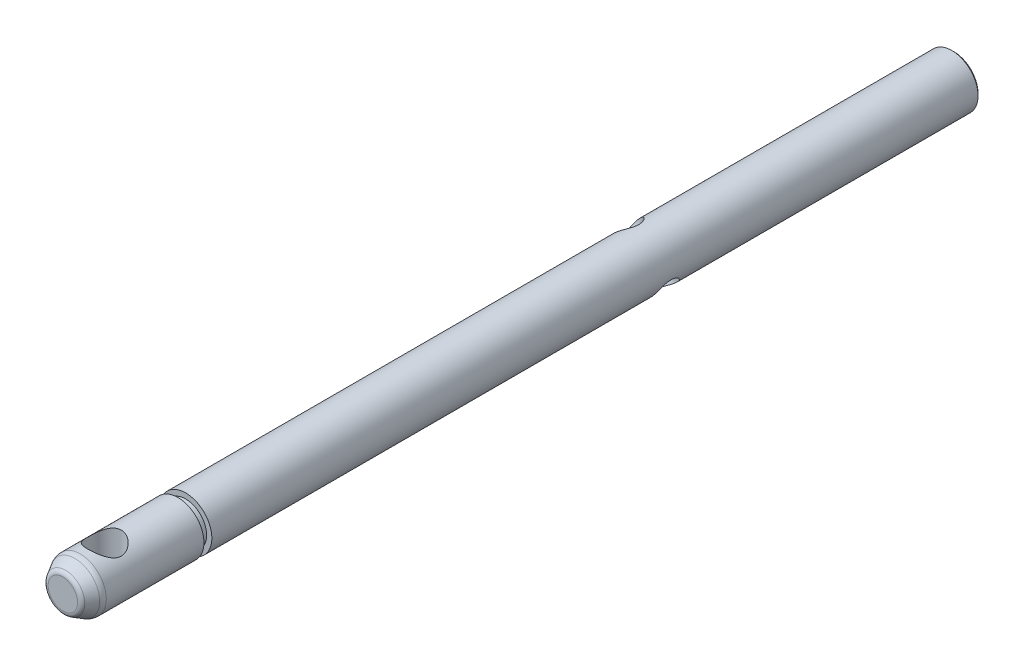
ISO-10303-21;
HEADER;
FILE_DESCRIPTION(('STEP AP214'),'2;1');
FILE_NAME('part.step','',(''),(''),'','','');
FILE_SCHEMA(('AUTOMOTIVE_DESIGN { 1 0 10303 214 1 1 1 1 }'));
ENDSEC;
DATA;
#1=APPLICATION_CONTEXT('core data for automotive mechanical design processes');
#2=APPLICATION_PROTOCOL_DEFINITION('international standard','automotive_design',2000,#1);
#3=PRODUCT_CONTEXT('',#1,'mechanical');
#4=PRODUCT('Part','Part','',(#3));
#5=PRODUCT_RELATED_PRODUCT_CATEGORY('part','',(#4));
#6=PRODUCT_DEFINITION_FORMATION('','',#4);
#7=PRODUCT_DEFINITION_CONTEXT('part definition',#1,'design');
#8=PRODUCT_DEFINITION('design','',#6,#7);
#9=PRODUCT_DEFINITION_SHAPE('','',#8);
#10=(LENGTH_UNIT() NAMED_UNIT(*) SI_UNIT(.MILLI.,.METRE.));
#11=(NAMED_UNIT(*) PLANE_ANGLE_UNIT() SI_UNIT($,.RADIAN.));
#12=(NAMED_UNIT(*) SI_UNIT($,.STERADIAN.) SOLID_ANGLE_UNIT());
#13=UNCERTAINTY_MEASURE_WITH_UNIT(LENGTH_MEASURE(1.E-05),#10,'distance_accuracy_value','');
#14=(GEOMETRIC_REPRESENTATION_CONTEXT(3) GLOBAL_UNCERTAINTY_ASSIGNED_CONTEXT((#13)) GLOBAL_UNIT_ASSIGNED_CONTEXT((#10,
#11,#12)) REPRESENTATION_CONTEXT('',''));
#15=CARTESIAN_POINT('',(0.,0.,0.));
#16=DIRECTION('',(0.,0.,1.));
#17=DIRECTION('',(1.,0.,0.));
#18=AXIS2_PLACEMENT_3D('',#15,#16,#17);
#19=CARTESIAN_POINT('',(0.,0.,10.3643593547193));
#20=DIRECTION('',(0.,0.,-1.));
#21=DIRECTION('',(-1.,0.,0.));
#22=AXIS2_PLACEMENT_3D('',#19,#20,#21);
#23=CONICAL_SURFACE('',#22,2.4999999995529,0.523598775598287);
#24=CARTESIAN_POINT('',(0.,0.,11.5));
#25=DIRECTION('',(0.,0.,1.));
#26=DIRECTION('',(1.,0.,0.));
#27=AXIS2_PLACEMENT_3D('',#24,#25,#26);
#28=CIRCLE('',#27,1.84433756729739);
#29=CARTESIAN_POINT('',(1.84433756729739,0.,11.5));
#30=VERTEX_POINT('',#29);
#31=EDGE_CURVE('E52',#30,#30,#28,.F.);
#32=ORIENTED_EDGE('',*,*,#31,.T.);
#33=EDGE_LOOP('',(#32));
#34=FACE_BOUND('',#33,.T.);
#35=CARTESIAN_POINT('',(0.,0.,10.5964101622881));
#36=DIRECTION('',(0.,0.,1.));
#37=DIRECTION('',(1.,0.,0.));
#38=AXIS2_PLACEMENT_3D('',#35,#36,#37);
#39=CIRCLE('',#38,2.36602540333735);
#40=CARTESIAN_POINT('',(2.36602540333735,0.,10.5964101622881));
#41=VERTEX_POINT('',#40);
#42=EDGE_CURVE('E163',#41,#41,#39,.T.);
#43=ORIENTED_EDGE('',*,*,#42,.T.);
#44=EDGE_LOOP('',(#43));
#45=FACE_BOUND('',#44,.T.);
#46=ADVANCED_FACE('F45',(#34,#45),#23,.T.);
#47=CARTESIAN_POINT('',(1.69999999999998,0.,11.75));
#48=DIRECTION('',(0.,0.,1.));
#49=DIRECTION('',(1.,0.,0.));
#50=AXIS2_PLACEMENT_3D('',#47,#48,#49);
#51=PLANE('',#50);
#52=CARTESIAN_POINT('',(0.,0.,11.75));
#53=DIRECTION('',(0.,0.,1.));
#54=DIRECTION('',(1.,0.,0.));
#55=AXIS2_PLACEMENT_3D('',#52,#53,#54);
#56=CIRCLE('',#55,1.41132486540517);
#57=CARTESIAN_POINT('',(1.41132486540517,0.,11.75));
#58=VERTEX_POINT('',#57);
#59=EDGE_CURVE('E12',#58,#58,#56,.T.);
#60=ORIENTED_EDGE('',*,*,#59,.T.);
#61=EDGE_LOOP('',(#60));
#62=FACE_BOUND('',#61,.T.);
#63=ADVANCED_FACE('F141',(#62),#51,.T.);
#64=CARTESIAN_POINT('',(0.,0.,-73.5));
#65=DIRECTION('',(0.,0.,-1.));
#66=DIRECTION('',(-1.,0.,0.));
#67=AXIS2_PLACEMENT_3D('',#64,#65,#66);
#68=PLANE('',#67);
#69=CARTESIAN_POINT('',(0.,0.,-73.5));
#70=DIRECTION('',(0.,0.,-1.));
#71=DIRECTION('',(-1.,0.,0.));
#72=AXIS2_PLACEMENT_3D('',#69,#70,#71);
#73=CIRCLE('',#72,2.29999999955291);
#74=CARTESIAN_POINT('',(-2.29999999955291,0.,-73.5));
#75=VERTEX_POINT('',#74);
#76=EDGE_CURVE('E127',#75,#75,#73,.T.);
#77=ORIENTED_EDGE('',*,*,#76,.T.);
#78=EDGE_LOOP('',(#77));
#79=FACE_BOUND('',#78,.T.);
#80=CARTESIAN_POINT('',(0.,0.,-73.5));
#81=DIRECTION('',(0.,0.,-1.));
#82=DIRECTION('',(-1.,0.,0.));
#83=AXIS2_PLACEMENT_3D('',#80,#81,#82);
#84=CIRCLE('',#83,1.5);
#85=CARTESIAN_POINT('',(-1.5,0.,-73.5));
#86=VERTEX_POINT('',#85);
#87=EDGE_CURVE('E76',#86,#86,#84,.T.);
#88=ORIENTED_EDGE('',*,*,#87,.F.);
#89=EDGE_LOOP('',(#88));
#90=FACE_BOUND('',#89,.T.);
#91=ADVANCED_FACE('F135',(#79,#90),#68,.T.);
#92=CARTESIAN_POINT('',(0.,0.,11.75));
#93=DIRECTION('',(0.,0.,-1.));
#94=DIRECTION('',(-1.,0.,0.));
#95=AXIS2_PLACEMENT_3D('',#92,#93,#94);
#96=CYLINDRICAL_SURFACE('',#95,2.4999999995529);
#97=CARTESIAN_POINT('',(0.,0.,-73.3));
#98=DIRECTION('',(0.,0.,-1.));
#99=DIRECTION('',(-1.,0.,0.));
#100=AXIS2_PLACEMENT_3D('',#97,#98,#99);
#101=CIRCLE('',#100,2.4999999995529);
#102=CARTESIAN_POINT('',(-2.4999999995529,0.,-73.3));
#103=VERTEX_POINT('',#102);
#104=EDGE_CURVE('E168',#103,#103,#101,.F.);
#105=ORIENTED_EDGE('',*,*,#104,.T.);
#106=EDGE_LOOP('',(#105));
#107=FACE_BOUND('',#106,.T.);
#108=CARTESIAN_POINT('',(0.647047612391243,-2.41481456535761,-44.));
#109=CARTESIAN_POINT('',(0.647054839589281,-2.414815363319,-44.0651347602423));
#110=CARTESIAN_POINT('',(0.652781570956877,-2.41330062767963,-44.1303517644026));
#111=CARTESIAN_POINT('',(0.675198989154534,-2.40712130266853,-44.258784080839));
#112=CARTESIAN_POINT('',(0.691912714261657,-2.40245009401281,-44.3219948937949));
#113=CARTESIAN_POINT('',(0.734854992081506,-2.38966154607353,-44.4443145804166));
#114=CARTESIAN_POINT('',(0.761032937966934,-2.38156249745004,-44.5034433155767));
#115=CARTESIAN_POINT('',(0.821268395297311,-2.36146633386545,-44.6167802524769));
#116=CARTESIAN_POINT('',(0.855326333007327,-2.34946900801437,-44.6709881878074));
#117=CARTESIAN_POINT('',(0.932764132759461,-2.319871712233,-44.7778821606749));
#118=CARTESIAN_POINT('',(0.976681165090613,-2.30189126083676,-44.8300739195701));
#119=CARTESIAN_POINT('',(1.06991091377899,-2.26006674587122,-44.9267604854874));
#120=CARTESIAN_POINT('',(1.11922630165018,-2.23621977175588,-44.971251453209));
#121=CARTESIAN_POINT('',(1.22481961227848,-2.18027920094425,-45.0542089389173));
#122=CARTESIAN_POINT('',(1.28134278420145,-2.14773807638739,-45.0920672098093));
#123=CARTESIAN_POINT('',(1.39596184058318,-2.07506193699265,-45.1564260665464));
#124=CARTESIAN_POINT('',(1.45405670780787,-2.03493173775572,-45.1829338201628));
#125=CARTESIAN_POINT('',(1.56514521148729,-1.95059785765576,-45.2218808266209));
#126=CARTESIAN_POINT('',(1.6182076915843,-1.90688720020561,-45.2351869079403));
#127=CARTESIAN_POINT('',(1.72136767494027,-1.81430029508382,-45.2502076483425));
#128=CARTESIAN_POINT('',(1.77146695399875,-1.76542719113136,-45.2519293209947));
#129=CARTESIAN_POINT('',(1.86275114247436,-1.66859283547372,-45.2440666575398));
#130=CARTESIAN_POINT('',(1.90433239278944,-1.6209218750637,-45.2354524806028));
#131=CARTESIAN_POINT('',(1.98260033333465,-1.52419401693175,-45.2088989451273));
#132=CARTESIAN_POINT('',(2.01928665704908,-1.47513701576061,-45.19095888879));
#133=CARTESIAN_POINT('',(2.08775506658209,-1.37656581934683,-45.1461467924029));
#134=CARTESIAN_POINT('',(2.1194622776723,-1.32705468907948,-45.119154608553));
#135=CARTESIAN_POINT('',(2.17731724412714,-1.22983516690986,-45.0571707297724));
#136=CARTESIAN_POINT('',(2.20346300264108,-1.18212742755732,-45.0221761708998));
#137=CARTESIAN_POINT('',(2.25268098848386,-1.08564780758512,-44.9413808106183));
#138=CARTESIAN_POINT('',(2.27522905936719,-1.03720162554881,-44.8948712146303));
#139=CARTESIAN_POINT('',(2.31457949972472,-0.946143375817124,-44.7942628438816));
#140=CARTESIAN_POINT('',(2.33137745599567,-0.903535804217852,-44.7401582847051));
#141=CARTESIAN_POINT('',(2.36080582719395,-0.823723031227638,-44.6216897595221));
#142=CARTESIAN_POINT('',(2.3731038454062,-0.787032726395938,-44.5568924712353));
#143=CARTESIAN_POINT('',(2.39273763825298,-0.725169284214916,-44.421327910855));
#144=CARTESIAN_POINT('',(2.40007859359442,-0.699984131580012,-44.3505669587816));
#145=CARTESIAN_POINT('',(2.41002017068561,-0.664915617025871,-44.2109818609492));
#146=CARTESIAN_POINT('',(2.41295034288321,-0.65397781463655,-44.1424486012477));
#147=CARTESIAN_POINT('',(2.41538496423121,-0.64493640317592,-44.0044983231546));
#148=CARTESIAN_POINT('',(2.41489183324915,-0.646823728247396,-43.9350819636493));
#149=CARTESIAN_POINT('',(2.41068559313306,-0.662300360405999,-43.8054326018269));
#150=CARTESIAN_POINT('',(2.40733062162319,-0.674586991523311,-43.7450256861679));
#151=CARTESIAN_POINT('',(2.39765457982992,-0.708206270758844,-43.6270402672186));
#152=CARTESIAN_POINT('',(2.39133254893351,-0.72954184834184,-43.5694626866261));
#153=CARTESIAN_POINT('',(2.37500357133458,-0.781100760934234,-43.4557358364347));
#154=CARTESIAN_POINT('',(2.36483951834154,-0.811689967423389,-43.3997762289978));
#155=CARTESIAN_POINT('',(2.34038932402502,-0.879706358529646,-43.2931634106434));
#156=CARTESIAN_POINT('',(2.32610106381395,-0.917137054453419,-43.2425129456762));
#157=CARTESIAN_POINT('',(2.29077596584783,-1.00236170749265,-43.1412765406612));
#158=CARTESIAN_POINT('',(2.26911547503706,-1.05086723675192,-43.0915035616659));
#159=CARTESIAN_POINT('',(2.21920764978906,-1.15252912344673,-43.0007347025646));
#160=CARTESIAN_POINT('',(2.19095809709732,-1.20568704336891,-42.9597417872648));
#161=CARTESIAN_POINT('',(2.12657854793458,-1.31599488711738,-42.8867828426057));
#162=CARTESIAN_POINT('',(2.09026024861407,-1.37321314124186,-42.8550836022741));
#163=CARTESIAN_POINT('',(2.01026561196557,-1.48785094176887,-42.8035776202047));
#164=CARTESIAN_POINT('',(1.96659577896656,-1.54527026667838,-42.783760435813));
#165=CARTESIAN_POINT('',(1.87706335552591,-1.65259286928383,-42.7582892947925));
#166=CARTESIAN_POINT('',(1.83176959422813,-1.7027023764808,-42.751502655161));
#167=CARTESIAN_POINT('',(1.73709205755758,-1.79918661459383,-42.748945918179));
#168=CARTESIAN_POINT('',(1.68770971981163,-1.84556264705788,-42.7531719643381));
#169=CARTESIAN_POINT('',(1.58993109636592,-1.93029339625746,-42.7717705084784));
#170=CARTESIAN_POINT('',(1.54168425741229,-1.96897530484538,-42.7854560615513));
#171=CARTESIAN_POINT('',(1.44468543123078,-2.04121123379296,-42.8216587490984));
#172=CARTESIAN_POINT('',(1.39593337253776,-2.07476451781911,-42.8441771500815));
#173=CARTESIAN_POINT('',(1.29739589904163,-2.13783368514683,-42.8984088151614));
#174=CARTESIAN_POINT('',(1.24765546958488,-2.16711550813563,-42.9304741539578));
#175=CARTESIAN_POINT('',(1.15091058730697,-2.2200112129777,-43.0024474135096));
#176=CARTESIAN_POINT('',(1.10390740400748,-2.24362248046623,-43.042358936324));
#177=CARTESIAN_POINT('',(1.00972382125355,-2.28766730752604,-43.1334964236954));
#178=CARTESIAN_POINT('',(0.962991317457852,-2.30755076858136,-43.1854531092577));
#179=CARTESIAN_POINT('',(0.876783659406933,-2.34166723390337,-43.2968134013121));
#180=CARTESIAN_POINT('',(0.837314932917578,-2.35589524641306,-43.3562235259789));
#181=CARTESIAN_POINT('',(0.766826344342654,-2.37979185397499,-43.4832958081133));
#182=CARTESIAN_POINT('',(0.736112899077592,-2.38930215352926,-43.5511594137968));
#183=CARTESIAN_POINT('',(0.687469412415883,-2.40375671037896,-43.6916655053102));
#184=CARTESIAN_POINT('',(0.669496628789736,-2.40871625115548,-43.764291111027));
#185=CARTESIAN_POINT('',(0.654891999223841,-2.41270113483274,-43.8647566944711));
#186=CARTESIAN_POINT('',(0.651957034909512,-2.41349456267658,-43.8917098679221));
#187=CARTESIAN_POINT('',(0.648033271709243,-2.41455112954277,-43.945770600815));
#188=CARTESIAN_POINT('',(0.647044603017562,-2.41481423308998,-43.9728781704634));
#189=CARTESIAN_POINT('',(0.647047612391243,-2.41481456535761,-44.));
#190=B_SPLINE_CURVE_WITH_KNOTS('',3,(#108,#109,#110,#111,#112,#113,#114,#115,#116,#117,#118,
#119,#120,#121,#122,#123,#124,#125,#126,#127,#128,#129,#130,#131,#132,#133,#134,#135,#136,#137,
#138,#139,#140,#141,#142,#143,#144,#145,#146,#147,#148,#149,#150,#151,#152,#153,#154,#155,#156,
#157,#158,#159,#160,#161,#162,#163,#164,#165,#166,#167,#168,#169,#170,#171,#172,#173,#174,#175,
#176,#177,#178,#179,#180,#181,#182,#183,#184,#185,#186,#187,#188,#189),.UNSPECIFIED.,.T.,.F.,(4,
2,2,2,2,2,2,2,2,2,2,2,2,2,2,2,2,2,2,2,2,2,2,2,2,2,2,2,2,2,2,2,2,2,2,2,2,2,2,2,4),(0.,
0.195290153237882,0.390991116019818,0.58566074488149,0.78034090678345,0.991077890599507,
1.20191963853108,1.42697365296704,1.65188533703714,1.8607935620885,2.06957529606556,
2.26020121854114,2.45084140644694,2.64411918411161,2.8374662418442,3.04908989317466,
3.26087560303533,3.48611052158554,3.71110967761977,3.91827863565462,4.12530116483504,
4.30967729277165,4.4941131554131,4.6870912050286,4.8801685776933,5.0975842946998,
5.31507331216917,5.53830226761101,5.7613347475658,5.96390337982664,6.16640108488456,
6.35555531084749,6.5447366688479,6.74200938393286,6.93937287619017,7.15637802305408,
7.37357428548982,7.59763436291689,7.82093916247776,7.90225168981629,7.98356965623837),.UNSPECIFIED.);
#191=CARTESIAN_POINT('',(0.647047612391243,-2.41481456535761,-44.));
#192=VERTEX_POINT('',#191);
#193=EDGE_CURVE('E67',#192,#192,#190,.T.);
#194=ORIENTED_EDGE('',*,*,#193,.F.);
#195=EDGE_LOOP('',(#194));
#196=FACE_BOUND('',#195,.T.);
#197=CARTESIAN_POINT('',(-2.41481456535761,0.647047612391244,-44.));
#198=CARTESIAN_POINT('',(-2.414815363319,0.647054839589282,-43.9348652397577));
#199=CARTESIAN_POINT('',(-2.41330062767963,0.652781570956878,-43.8696482355974));
#200=CARTESIAN_POINT('',(-2.40712130266853,0.675198989154535,-43.741215919161));
#201=CARTESIAN_POINT('',(-2.40245009401281,0.691912714261658,-43.6780051062051));
#202=CARTESIAN_POINT('',(-2.38966154607354,0.734854992081505,-43.5556854195834));
#203=CARTESIAN_POINT('',(-2.38156249745004,0.76103293796693,-43.4965566844233));
#204=CARTESIAN_POINT('',(-2.36146633386545,0.821268395297306,-43.3832197475231));
#205=CARTESIAN_POINT('',(-2.34946900801437,0.855326333007324,-43.3290118121926));
#206=CARTESIAN_POINT('',(-2.319871712233,0.932764132759461,-43.2221178393251));
#207=CARTESIAN_POINT('',(-2.30189126083676,0.976681165090613,-43.1699260804299));
#208=CARTESIAN_POINT('',(-2.26006674587122,1.06991091377899,-43.0732395145126));
#209=CARTESIAN_POINT('',(-2.23621977175588,1.11922630165018,-43.028748546791));
#210=CARTESIAN_POINT('',(-2.18027920094425,1.22481961227848,-42.9457910610827));
#211=CARTESIAN_POINT('',(-2.14773807638739,1.28134278420145,-42.9079327901907));
#212=CARTESIAN_POINT('',(-2.07506193699265,1.39596184058317,-42.8435739334536));
#213=CARTESIAN_POINT('',(-2.03493173775572,1.45405670780787,-42.8170661798372));
#214=CARTESIAN_POINT('',(-1.95059785765576,1.56514521148729,-42.7781191733791));
#215=CARTESIAN_POINT('',(-1.90688720020561,1.6182076915843,-42.7648130920596));
#216=CARTESIAN_POINT('',(-1.81430029508382,1.72136767494027,-42.7497923516575));
#217=CARTESIAN_POINT('',(-1.76542719113136,1.77146695399875,-42.7480706790053));
#218=CARTESIAN_POINT('',(-1.66859283547373,1.86275114247436,-42.7559333424602));
#219=CARTESIAN_POINT('',(-1.6209218750637,1.90433239278944,-42.7645475193972));
#220=CARTESIAN_POINT('',(-1.52419401693175,1.98260033333465,-42.7911010548727));
#221=CARTESIAN_POINT('',(-1.47513701576061,2.01928665704908,-42.80904111121));
#222=CARTESIAN_POINT('',(-1.37656581934683,2.08775506658209,-42.8538532075971));
#223=CARTESIAN_POINT('',(-1.32705468907948,2.1194622776723,-42.880845391447));
#224=CARTESIAN_POINT('',(-1.22983516690986,2.17731724412714,-42.9428292702275));
#225=CARTESIAN_POINT('',(-1.18212742755732,2.20346300264108,-42.9778238291002));
#226=CARTESIAN_POINT('',(-1.08564780758512,2.25268098848386,-43.0586191893817));
#227=CARTESIAN_POINT('',(-1.03720162554881,2.27522905936719,-43.1051287853697));
#228=CARTESIAN_POINT('',(-0.946143375817123,2.31457949972473,-43.2057371561184));
#229=CARTESIAN_POINT('',(-0.903535804217849,2.33137745599567,-43.2598417152949));
#230=CARTESIAN_POINT('',(-0.823723031227635,2.36080582719395,-43.3783102404779));
#231=CARTESIAN_POINT('',(-0.787032726395938,2.3731038454062,-43.4431075287647));
#232=CARTESIAN_POINT('',(-0.725169284214917,2.39273763825297,-43.578672089145));
#233=CARTESIAN_POINT('',(-0.699984131580012,2.40007859359442,-43.6494330412184));
#234=CARTESIAN_POINT('',(-0.66491561702587,2.41002017068561,-43.7890181390508));
#235=CARTESIAN_POINT('',(-0.65397781463655,2.41295034288321,-43.8575513987523));
#236=CARTESIAN_POINT('',(-0.644936403175921,2.41538496423121,-43.9955016768453));
#237=CARTESIAN_POINT('',(-0.646823728247396,2.41489183324915,-44.0649180363507));
#238=CARTESIAN_POINT('',(-0.662300360405999,2.41068559313306,-44.1945673981731));
#239=CARTESIAN_POINT('',(-0.67458699152331,2.40733062162319,-44.2549743138321));
#240=CARTESIAN_POINT('',(-0.708206270758841,2.39765457982992,-44.3729597327813));
#241=CARTESIAN_POINT('',(-0.729541848341837,2.39133254893351,-44.4305373133739));
#242=CARTESIAN_POINT('',(-0.781100760934233,2.37500357133458,-44.5442641635653));
#243=CARTESIAN_POINT('',(-0.811689967423389,2.36483951834154,-44.6002237710022));
#244=CARTESIAN_POINT('',(-0.879706358529646,2.34038932402502,-44.7068365893566));
#245=CARTESIAN_POINT('',(-0.917137054453419,2.32610106381395,-44.7574870543237));
#246=CARTESIAN_POINT('',(-1.00236170749265,2.29077596584783,-44.8587234593388));
#247=CARTESIAN_POINT('',(-1.05086723675191,2.26911547503707,-44.9084964383341));
#248=CARTESIAN_POINT('',(-1.15252912344673,2.21920764978907,-44.9992652974354));
#249=CARTESIAN_POINT('',(-1.20568704336891,2.19095809709732,-45.0402582127352));
#250=CARTESIAN_POINT('',(-1.31599488711738,2.12657854793458,-45.1132171573943));
#251=CARTESIAN_POINT('',(-1.37321314124186,2.09026024861407,-45.1449163977259));
#252=CARTESIAN_POINT('',(-1.48785094176887,2.01026561196557,-45.1964223797953));
#253=CARTESIAN_POINT('',(-1.54527026667837,1.96659577896656,-45.216239564187));
#254=CARTESIAN_POINT('',(-1.65259286928383,1.87706335552591,-45.2417107052075));
#255=CARTESIAN_POINT('',(-1.7027023764808,1.83176959422813,-45.248497344839));
#256=CARTESIAN_POINT('',(-1.79918661459383,1.73709205755758,-45.251054081821));
#257=CARTESIAN_POINT('',(-1.84556264705788,1.68770971981163,-45.2468280356619));
#258=CARTESIAN_POINT('',(-1.93029339625746,1.58993109636592,-45.2282294915216));
#259=CARTESIAN_POINT('',(-1.96897530484538,1.54168425741229,-45.2145439384487));
#260=CARTESIAN_POINT('',(-2.04121123379296,1.44468543123078,-45.1783412509016));
#261=CARTESIAN_POINT('',(-2.07476451781911,1.39593337253776,-45.1558228499185));
#262=CARTESIAN_POINT('',(-2.13783368514683,1.29739589904163,-45.1015911848386));
#263=CARTESIAN_POINT('',(-2.16711550813563,1.24765546958488,-45.0695258460422));
#264=CARTESIAN_POINT('',(-2.2200112129777,1.15091058730697,-44.9975525864904));
#265=CARTESIAN_POINT('',(-2.24362248046623,1.10390740400748,-44.957641063676));
#266=CARTESIAN_POINT('',(-2.28766730752604,1.00972382125355,-44.8665035763046));
#267=CARTESIAN_POINT('',(-2.30755076858136,0.962991317457856,-44.8145468907423));
#268=CARTESIAN_POINT('',(-2.34166723390337,0.876783659406935,-44.7031865986879));
#269=CARTESIAN_POINT('',(-2.35589524641306,0.83731493291758,-44.6437764740211));
#270=CARTESIAN_POINT('',(-2.37979185397499,0.766826344342654,-44.5167041918867));
#271=CARTESIAN_POINT('',(-2.38930215352926,0.736112899077592,-44.4488405862032));
#272=CARTESIAN_POINT('',(-2.40375671037896,0.687469412415883,-44.3083344946898));
#273=CARTESIAN_POINT('',(-2.40871625115548,0.669496628789735,-44.235708888973));
#274=CARTESIAN_POINT('',(-2.41270113483274,0.654891999223841,-44.1352433055289));
#275=CARTESIAN_POINT('',(-2.41349456267658,0.651957034909512,-44.1082901320779));
#276=CARTESIAN_POINT('',(-2.41455112954277,0.648033271709244,-44.054229399185));
#277=CARTESIAN_POINT('',(-2.41481423308998,0.647044603017562,-44.0271218295366));
#278=CARTESIAN_POINT('',(-2.41481456535761,0.647047612391244,-44.));
#279=B_SPLINE_CURVE_WITH_KNOTS('',3,(#197,#198,#199,#200,#201,#202,#203,#204,#205,#206,#207,
#208,#209,#210,#211,#212,#213,#214,#215,#216,#217,#218,#219,#220,#221,#222,#223,#224,#225,#226,
#227,#228,#229,#230,#231,#232,#233,#234,#235,#236,#237,#238,#239,#240,#241,#242,#243,#244,#245,
#246,#247,#248,#249,#250,#251,#252,#253,#254,#255,#256,#257,#258,#259,#260,#261,#262,#263,#264,
#265,#266,#267,#268,#269,#270,#271,#272,#273,#274,#275,#276,#277,#278),.UNSPECIFIED.,.T.,.F.,(4,
2,2,2,2,2,2,2,2,2,2,2,2,2,2,2,2,2,2,2,2,2,2,2,2,2,2,2,2,2,2,2,2,2,2,2,2,2,2,2,4),(0.,
0.195290153237882,0.390991116019818,0.585660744881481,0.78034090678345,0.991077890599507,
1.20191963853108,1.42697365296704,1.65188533703714,1.8607935620885,2.06957529606556,
2.26020121854114,2.45084140644694,2.64411918411161,2.8374662418442,3.04908989317466,
3.26087560303533,3.48611052158555,3.71110967761977,3.91827863565462,4.12530116483504,
4.30967729277164,4.4941131554131,4.6870912050286,4.8801685776933,5.0975842946998,
5.31507331216917,5.53830226761101,5.7613347475658,5.96390337982664,6.16640108488456,
6.35555531084749,6.5447366688479,6.74200938393286,6.93937287619017,7.15637802305407,
7.37357428548982,7.59763436291689,7.82093916247775,7.90225168981628,7.98356965623836),.UNSPECIFIED.);
#280=CARTESIAN_POINT('',(-2.41481456535761,0.647047612391244,-44.));
#281=VERTEX_POINT('',#280);
#282=EDGE_CURVE('E120',#281,#281,#279,.T.);
#283=ORIENTED_EDGE('',*,*,#282,.F.);
#284=EDGE_LOOP('',(#283));
#285=FACE_BOUND('',#284,.T.);
#286=CARTESIAN_POINT('',(0.,0.,0.));
#287=DIRECTION('',(0.,0.,-1.));
#288=DIRECTION('',(-1.,0.,0.));
#289=AXIS2_PLACEMENT_3D('',#286,#287,#288);
#290=CIRCLE('',#289,2.4999999995529);
#291=CARTESIAN_POINT('',(-2.4999999995529,0.,0.));
#292=VERTEX_POINT('',#291);
#293=EDGE_CURVE('E91',#292,#292,#290,.T.);
#294=ORIENTED_EDGE('',*,*,#293,.T.);
#295=EDGE_LOOP('',(#294));
#296=FACE_BOUND('',#295,.T.);
#297=ADVANCED_FACE('F129',(#107,#196,#285,#296),#96,.T.);
#298=CARTESIAN_POINT('',(2.4999999995529,0.,0.));
#299=DIRECTION('',(0.,0.,1.));
#300=DIRECTION('',(1.,0.,0.));
#301=AXIS2_PLACEMENT_3D('',#298,#299,#300);
#302=PLANE('',#301);
#303=CARTESIAN_POINT('',(0.,0.,0.));
#304=DIRECTION('',(0.,0.,-1.));
#305=DIRECTION('',(-1.,0.,0.));
#306=AXIS2_PLACEMENT_3D('',#303,#304,#305);
#307=CIRCLE('',#306,1.9999999995529);
#308=CARTESIAN_POINT('',(-1.9999999995529,0.,0.));
#309=VERTEX_POINT('',#308);
#310=EDGE_CURVE('E87',#309,#309,#307,.T.);
#311=ORIENTED_EDGE('',*,*,#310,.T.);
#312=EDGE_LOOP('',(#311));
#313=FACE_BOUND('',#312,.T.);
#314=ORIENTED_EDGE('',*,*,#293,.F.);
#315=EDGE_LOOP('',(#314));
#316=FACE_BOUND('',#315,.T.);
#317=ADVANCED_FACE('F134',(#313,#316),#302,.T.);
#318=CARTESIAN_POINT('',(0.,0.,11.75));
#319=DIRECTION('',(0.,0.,-1.));
#320=DIRECTION('',(-1.,0.,0.));
#321=AXIS2_PLACEMENT_3D('',#318,#319,#320);
#322=CYLINDRICAL_SURFACE('',#321,1.9999999995529);
#323=CARTESIAN_POINT('',(0.,0.,0.750000000000001));
#324=DIRECTION('',(0.,0.,-1.));
#325=DIRECTION('',(-1.,0.,0.));
#326=AXIS2_PLACEMENT_3D('',#323,#324,#325);
#327=CIRCLE('',#326,1.9999999995529);
#328=CARTESIAN_POINT('',(-1.9999999995529,0.,0.750000000000001));
#329=VERTEX_POINT('',#328);
#330=EDGE_CURVE('E83',#329,#329,#327,.T.);
#331=ORIENTED_EDGE('',*,*,#330,.T.);
#332=EDGE_LOOP('',(#331));
#333=FACE_BOUND('',#332,.T.);
#334=ORIENTED_EDGE('',*,*,#310,.F.);
#335=EDGE_LOOP('',(#334));
#336=FACE_BOUND('',#335,.T.);
#337=ADVANCED_FACE('F195',(#333,#336),#322,.T.);
#338=CARTESIAN_POINT('',(1.9999999995529,0.,0.75));
#339=DIRECTION('',(0.,0.,-1.));
#340=DIRECTION('',(-1.,0.,0.));
#341=AXIS2_PLACEMENT_3D('',#338,#339,#340);
#342=PLANE('',#341);
#343=CARTESIAN_POINT('',(0.,0.,0.750000000000001));
#344=DIRECTION('',(0.,0.,-1.));
#345=DIRECTION('',(-1.,0.,0.));
#346=AXIS2_PLACEMENT_3D('',#343,#344,#345);
#347=CIRCLE('',#346,2.4999999995529);
#348=CARTESIAN_POINT('',(-2.4999999995529,0.,0.750000000000001));
#349=VERTEX_POINT('',#348);
#350=EDGE_CURVE('E73',#349,#349,#347,.T.);
#351=ORIENTED_EDGE('',*,*,#350,.T.);
#352=EDGE_LOOP('',(#351));
#353=FACE_BOUND('',#352,.T.);
#354=ORIENTED_EDGE('',*,*,#330,.F.);
#355=EDGE_LOOP('',(#354));
#356=FACE_BOUND('',#355,.T.);
#357=ADVANCED_FACE('F188',(#353,#356),#342,.T.);
#358=CARTESIAN_POINT('',(0.,0.,11.75));
#359=DIRECTION('',(0.,0.,-1.));
#360=DIRECTION('',(-1.,0.,0.));
#361=AXIS2_PLACEMENT_3D('',#358,#359,#360);
#362=CYLINDRICAL_SURFACE('',#361,2.4999999995529);
#363=CARTESIAN_POINT('',(0.,0.,10.0964101622882));
#364=DIRECTION('',(0.,0.,1.));
#365=DIRECTION('',(1.,0.,0.));
#366=AXIS2_PLACEMENT_3D('',#363,#364,#365);
#367=CIRCLE('',#366,2.4999999995529);
#368=CARTESIAN_POINT('',(2.4999999995529,0.,10.0964101622882));
#369=VERTEX_POINT('',#368);
#370=EDGE_CURVE('E166',#369,#369,#367,.F.);
#371=ORIENTED_EDGE('',*,*,#370,.T.);
#372=EDGE_LOOP('',(#371));
#373=FACE_BOUND('',#372,.T.);
#374=CARTESIAN_POINT('',(0.,2.4999999995529,6.16250000000001));
#375=CARTESIAN_POINT('',(-0.0804275392051982,2.49999381687466,6.16250672031375));
#376=CARTESIAN_POINT('',(-0.160945733368618,2.49607842290642,6.16865369871168));
#377=CARTESIAN_POINT('',(-0.319495971118263,2.48078563565156,6.19290706344977));
#378=CARTESIAN_POINT('',(-0.397523381333949,2.46939509896822,6.21103451521904));
#379=CARTESIAN_POINT('',(-0.548493707169813,2.44029448228292,6.25817733497047));
#380=CARTESIAN_POINT('',(-0.621459800405662,2.42261584566326,6.28713856568991));
#381=CARTESIAN_POINT('',(-0.761231628588198,2.38239866026354,6.35475202230376));
#382=CARTESIAN_POINT('',(-0.828037851445758,2.35986049686968,6.39340347975144));
#383=CARTESIAN_POINT('',(-0.959724818114332,2.30960784741239,6.48275038631689));
#384=CARTESIAN_POINT('',(-1.02400939198218,2.28162172659834,6.53416866255847));
#385=CARTESIAN_POINT('',(-1.14361862576886,2.22408452187956,6.64591457133048));
#386=CARTESIAN_POINT('',(-1.19893077588178,2.19453132792663,6.70625442263305));
#387=CARTESIAN_POINT('',(-1.3069546501548,2.13219988809498,6.84405393653575));
#388=CARTESIAN_POINT('',(-1.35820554323428,2.0995529170316,6.92272783905008));
#389=CARTESIAN_POINT('',(-1.44662545004025,2.0396406103653,7.08947237276206));
#390=CARTESIAN_POINT('',(-1.48381851858542,2.0123661203863,7.17752661884373));
#391=CARTESIAN_POINT('',(-1.53439622302443,1.9739192053728,7.33674306231646));
#392=CARTESIAN_POINT('',(-1.55148386025607,1.96039283703814,7.40615627140271));
#393=CARTESIAN_POINT('',(-1.57617722459468,1.94059884516149,7.54761924769073));
#394=CARTESIAN_POINT('',(-1.58379701410545,1.9343204573257,7.61966494066924));
#395=CARTESIAN_POINT('',(-1.589092580576,1.92997399692327,7.76459113219757));
#396=CARTESIAN_POINT('',(-1.58673923929864,1.93192996583977,7.83747345478343));
#397=CARTESIAN_POINT('',(-1.57218636529963,1.94378790374723,7.98160966518206));
#398=CARTESIAN_POINT('',(-1.55997878007033,1.95369637117491,8.05286217218604));
#399=CARTESIAN_POINT('',(-1.52690348005677,1.97964301732356,8.18996101002669));
#400=CARTESIAN_POINT('',(-1.50628206140916,1.99550591492531,8.25590195136796));
#401=CARTESIAN_POINT('',(-1.4572251001066,2.03160537021701,8.38350592466722));
#402=CARTESIAN_POINT('',(-1.42878694487633,2.05184338971323,8.44516751770005));
#403=CARTESIAN_POINT('',(-1.35866140720083,2.09908233896638,8.57500452540884));
#404=CARTESIAN_POINT('',(-1.31548039383626,2.12663648499627,8.64217115808508));
#405=CARTESIAN_POINT('',(-1.21983273164209,2.18290959046873,8.76906204916195));
#406=CARTESIAN_POINT('',(-1.16735520450881,2.21162988379472,8.82877744744926));
#407=CARTESIAN_POINT('',(-1.04370244253084,2.27293787683566,8.94982856939706));
#408=CARTESIAN_POINT('',(-0.970861848398988,2.30531321820416,9.0095892238956));
#409=CARTESIAN_POINT('',(-0.814364551462792,2.3651221723891,9.1159758117456));
#410=CARTESIAN_POINT('',(-0.730719736921935,2.39256113862298,9.16261600535369));
#411=CARTESIAN_POINT('',(-0.571969226486686,2.4347904388349,9.23289589154257));
#412=CARTESIAN_POINT('',(-0.498449854091981,2.45100932915596,9.25926080586621));
#413=CARTESIAN_POINT('',(-0.347271420108123,2.47694719881131,9.30103011910175));
#414=CARTESIAN_POINT('',(-0.269615699691995,2.48667134088164,9.31644322433294));
#415=CARTESIAN_POINT('',(-0.112039240217214,2.49874133442846,9.33553465589815));
#416=CARTESIAN_POINT('',(-0.0321120932009238,2.50106366457121,9.33917557333183));
#417=CARTESIAN_POINT('',(0.12723817366737,2.49803135551851,9.33439907188945));
#418=CARTESIAN_POINT('',(0.206661253407543,2.49267611287652,9.32598070517045));
#419=CARTESIAN_POINT('',(0.358622611449646,2.47526798593522,9.2982942774253));
#420=CARTESIAN_POINT('',(0.43130642128093,2.46356439285183,9.27959139739134));
#421=CARTESIAN_POINT('',(0.572328835103325,2.43467164323183,9.23260734667775));
#422=CARTESIAN_POINT('',(0.64066670345513,2.41748156094322,9.20432455950189));
#423=CARTESIAN_POINT('',(0.776812304187603,2.37738868646586,9.13669812927832));
#424=CARTESIAN_POINT('',(0.844181300903703,2.35414996461167,9.09667492313317));
#425=CARTESIAN_POINT('',(0.971586610793016,2.30449650142683,9.00786186954462));
#426=CARTESIAN_POINT('',(1.03161695956553,2.27807921089582,8.95906496991882));
#427=CARTESIAN_POINT('',(1.15216359970719,2.21983024378288,8.84568308116972));
#428=CARTESIAN_POINT('',(1.21138281353309,2.18778358315101,8.77982660764648));
#429=CARTESIAN_POINT('',(1.31836288248172,2.12503297967234,8.638769679621));
#430=CARTESIAN_POINT('',(1.36612245915045,2.09432918695003,8.56356818399352));
#431=CARTESIAN_POINT('',(1.44300384022686,2.04195653290491,8.41616217301464));
#432=CARTESIAN_POINT('',(1.47381822928148,2.01962335221177,8.34508199443993));
#433=CARTESIAN_POINT('',(1.52505622349381,1.98122055719474,8.19769173877543));
#434=CARTESIAN_POINT('',(1.54549449823381,1.9651421075982,8.12138921923901));
#435=CARTESIAN_POINT('',(1.57497630961376,1.94160362754298,7.96451793386793));
#436=CARTESIAN_POINT('',(1.58391703340575,1.93422140856311,7.88391729661261));
#437=CARTESIAN_POINT('',(1.58931475859974,1.92979204607195,7.72203083028958));
#438=CARTESIAN_POINT('',(1.58577904375722,1.9327388724485,7.64074542863274));
#439=CARTESIAN_POINT('',(1.56787670945358,1.94726938947714,7.49156634286932));
#440=CARTESIAN_POINT('',(1.55504686330896,1.95762526371336,7.42335363919386));
#441=CARTESIAN_POINT('',(1.52101652607882,1.98418066979159,7.29022469558912));
#442=CARTESIAN_POINT('',(1.4998080417238,2.00038578056083,7.22531167051286));
#443=CARTESIAN_POINT('',(1.44115666572686,2.04323082085946,7.07806936260669));
#444=CARTESIAN_POINT('',(1.4006375171758,2.07154207650671,6.99745307418256));
#445=CARTESIAN_POINT('',(1.30737535518574,2.13163128276107,6.84505142386862));
#446=CARTESIAN_POINT('',(1.25461598245879,2.16341384247542,6.77327807905626));
#447=CARTESIAN_POINT('',(1.13725967949624,2.22736413621505,6.63876681433593));
#448=CARTESIAN_POINT('',(1.07254004079444,2.25953229406705,6.57613585581347));
#449=CARTESIAN_POINT('',(0.93256418038995,2.32081234940973,6.4621204406187));
#450=CARTESIAN_POINT('',(0.857308090003965,2.34992428498246,6.41073584380249));
#451=CARTESIAN_POINT('',(0.695415554833282,2.40286978264604,6.3198459088109));
#452=CARTESIAN_POINT('',(0.608547159668919,2.42655802361232,6.28065929161897));
#453=CARTESIAN_POINT('',(0.472928634844768,2.45529791568532,6.23382423388223));
#454=CARTESIAN_POINT('',(0.426875937420561,2.46374170226346,6.22020956789205));
#455=CARTESIAN_POINT('',(0.333367921192748,2.4781232572194,6.19715287898192));
#456=CARTESIAN_POINT('',(0.285913631062246,2.48406281691394,6.18770787320353));
#457=CARTESIAN_POINT('',(0.198749686348468,2.49239942704156,6.1744899152991));
#458=CARTESIAN_POINT('',(0.159189551474348,2.4952425894664,6.17000055226659));
#459=CARTESIAN_POINT('',(0.0797603847807521,2.49904443866585,6.16400388106299));
#460=CARTESIAN_POINT('',(0.0398913432750889,2.50000306610625,6.16249666678423));
#461=CARTESIAN_POINT('',(0.,2.4999999995529,6.16250000000001));
#462=B_SPLINE_CURVE_WITH_KNOTS('',3,(#374,#375,#376,#377,#378,#379,#380,#381,#382,#383,#384,
#385,#386,#387,#388,#389,#390,#391,#392,#393,#394,#395,#396,#397,#398,#399,#400,#401,#402,#403,
#404,#405,#406,#407,#408,#409,#410,#411,#412,#413,#414,#415,#416,#417,#418,#419,#420,#421,#422,
#423,#424,#425,#426,#427,#428,#429,#430,#431,#432,#433,#434,#435,#436,#437,#438,#439,#440,#441,
#442,#443,#444,#445,#446,#447,#448,#449,#450,#451,#452,#453,#454,#455,#456,#457,#458,#459,#460,
#461),.UNSPECIFIED.,.T.,.F.,(4,2,2,2,2,2,2,2,2,2,2,2,2,2,2,2,2,2,2,2,2,2,2,2,2,2,2,2,2,2,2,2,2,
2,2,2,2,2,2,2,2,2,2,4),(0.,0.241122297861018,0.482669696327969,0.723025845962207,
0.963362941087933,1.22320295470558,1.4834021930859,1.78021095898796,2.07650952102756,
2.29387501651157,2.51091727597226,2.7285936628182,2.94644810668649,3.15833699067443,
3.37029678023821,3.62278371267596,3.87556806775642,4.17297909119743,4.47006560701433,
4.70835488907824,4.94645452660831,5.18531004202236,5.42418433217716,5.65108119209244,
5.87801635726274,6.12227587622143,6.36673261276157,6.64812590331232,6.92955057193255,
7.17050255292755,7.41111292458367,7.6538602422443,7.8964658672668,8.10611058586138,
8.31595579158784,8.5981617828807,8.88074714299473,9.16641129357732,9.4520718842201,
9.74466832231763,9.89073000746784,10.0366870341784,10.1562777816031,10.2758722942576),.UNSPECIFIED.);
#463=CARTESIAN_POINT('',(0.,2.4999999995529,6.16250000000001));
#464=VERTEX_POINT('',#463);
#465=EDGE_CURVE('E102',#464,#464,#462,.T.);
#466=ORIENTED_EDGE('',*,*,#465,.F.);
#467=EDGE_LOOP('',(#466));
#468=FACE_BOUND('',#467,.T.);
#469=CARTESIAN_POINT('',(0.,-2.4999999995529,6.16250000000001));
#470=CARTESIAN_POINT('',(0.0804275392051982,-2.49999381687466,6.16250672031375));
#471=CARTESIAN_POINT('',(0.160945733368618,-2.49607842290642,6.16865369871168));
#472=CARTESIAN_POINT('',(0.319495971118263,-2.48078563565156,6.19290706344977));
#473=CARTESIAN_POINT('',(0.397523381333949,-2.46939509896822,6.21103451521904));
#474=CARTESIAN_POINT('',(0.548493707169813,-2.44029448228292,6.25817733497047));
#475=CARTESIAN_POINT('',(0.621459800405662,-2.42261584566326,6.28713856568991));
#476=CARTESIAN_POINT('',(0.761231628588198,-2.38239866026354,6.35475202230376));
#477=CARTESIAN_POINT('',(0.828037851445758,-2.35986049686968,6.39340347975144));
#478=CARTESIAN_POINT('',(0.959724818114332,-2.30960784741239,6.48275038631689));
#479=CARTESIAN_POINT('',(1.02400939198218,-2.28162172659834,6.53416866255847));
#480=CARTESIAN_POINT('',(1.14361862576886,-2.22408452187956,6.64591457133048));
#481=CARTESIAN_POINT('',(1.19893077588178,-2.19453132792663,6.70625442263305));
#482=CARTESIAN_POINT('',(1.3069546501548,-2.13219988809498,6.84405393653575));
#483=CARTESIAN_POINT('',(1.35820554323428,-2.0995529170316,6.92272783905008));
#484=CARTESIAN_POINT('',(1.44662545004025,-2.0396406103653,7.08947237276206));
#485=CARTESIAN_POINT('',(1.48381851858542,-2.0123661203863,7.17752661884373));
#486=CARTESIAN_POINT('',(1.53439622302443,-1.9739192053728,7.33674306231646));
#487=CARTESIAN_POINT('',(1.55148386025607,-1.96039283703814,7.40615627140271));
#488=CARTESIAN_POINT('',(1.57617722459468,-1.94059884516149,7.54761924769073));
#489=CARTESIAN_POINT('',(1.58379701410545,-1.9343204573257,7.61966494066924));
#490=CARTESIAN_POINT('',(1.589092580576,-1.92997399692327,7.76459113219757));
#491=CARTESIAN_POINT('',(1.58673923929864,-1.93192996583977,7.83747345478343));
#492=CARTESIAN_POINT('',(1.57218636529963,-1.94378790374723,7.98160966518206));
#493=CARTESIAN_POINT('',(1.55997878007033,-1.95369637117491,8.05286217218604));
#494=CARTESIAN_POINT('',(1.52690348005677,-1.97964301732356,8.18996101002669));
#495=CARTESIAN_POINT('',(1.50628206140916,-1.99550591492531,8.25590195136796));
#496=CARTESIAN_POINT('',(1.4572251001066,-2.03160537021701,8.38350592466722));
#497=CARTESIAN_POINT('',(1.42878694487633,-2.05184338971323,8.44516751770005));
#498=CARTESIAN_POINT('',(1.35866140720083,-2.09908233896638,8.57500452540884));
#499=CARTESIAN_POINT('',(1.31548039383626,-2.12663648499627,8.64217115808508));
#500=CARTESIAN_POINT('',(1.21983273164209,-2.18290959046873,8.76906204916195));
#501=CARTESIAN_POINT('',(1.16735520450881,-2.21162988379472,8.82877744744926));
#502=CARTESIAN_POINT('',(1.04370244253084,-2.27293787683566,8.94982856939706));
#503=CARTESIAN_POINT('',(0.970861848398988,-2.30531321820416,9.0095892238956));
#504=CARTESIAN_POINT('',(0.814364551462792,-2.3651221723891,9.1159758117456));
#505=CARTESIAN_POINT('',(0.730719736921935,-2.39256113862298,9.16261600535369));
#506=CARTESIAN_POINT('',(0.571969226486686,-2.4347904388349,9.23289589154257));
#507=CARTESIAN_POINT('',(0.498449854091981,-2.45100932915596,9.25926080586621));
#508=CARTESIAN_POINT('',(0.347271420108123,-2.47694719881131,9.30103011910175));
#509=CARTESIAN_POINT('',(0.269615699691995,-2.48667134088164,9.31644322433294));
#510=CARTESIAN_POINT('',(0.112039240217214,-2.49874133442846,9.33553465589815));
#511=CARTESIAN_POINT('',(0.0321120932009238,-2.50106366457121,9.33917557333183));
#512=CARTESIAN_POINT('',(-0.12723817366737,-2.49803135551851,9.33439907188945));
#513=CARTESIAN_POINT('',(-0.206661253407543,-2.49267611287652,9.32598070517045));
#514=CARTESIAN_POINT('',(-0.358622611449646,-2.47526798593522,9.2982942774253));
#515=CARTESIAN_POINT('',(-0.43130642128093,-2.46356439285183,9.27959139739134));
#516=CARTESIAN_POINT('',(-0.572328835103325,-2.43467164323183,9.23260734667775));
#517=CARTESIAN_POINT('',(-0.64066670345513,-2.41748156094322,9.20432455950189));
#518=CARTESIAN_POINT('',(-0.776812304187603,-2.37738868646586,9.13669812927832));
#519=CARTESIAN_POINT('',(-0.844181300903703,-2.35414996461167,9.09667492313317));
#520=CARTESIAN_POINT('',(-0.971586610793016,-2.30449650142683,9.00786186954462));
#521=CARTESIAN_POINT('',(-1.03161695956553,-2.27807921089582,8.95906496991882));
#522=CARTESIAN_POINT('',(-1.15216359970719,-2.21983024378288,8.84568308116972));
#523=CARTESIAN_POINT('',(-1.21138281353309,-2.18778358315101,8.77982660764648));
#524=CARTESIAN_POINT('',(-1.31836288248172,-2.12503297967234,8.638769679621));
#525=CARTESIAN_POINT('',(-1.36612245915045,-2.09432918695003,8.56356818399352));
#526=CARTESIAN_POINT('',(-1.44300384022686,-2.04195653290491,8.41616217301464));
#527=CARTESIAN_POINT('',(-1.47381822928148,-2.01962335221177,8.34508199443993));
#528=CARTESIAN_POINT('',(-1.52505622349381,-1.98122055719474,8.19769173877543));
#529=CARTESIAN_POINT('',(-1.54549449823381,-1.9651421075982,8.12138921923901));
#530=CARTESIAN_POINT('',(-1.57497630961376,-1.94160362754298,7.96451793386793));
#531=CARTESIAN_POINT('',(-1.58391703340575,-1.93422140856311,7.88391729661261));
#532=CARTESIAN_POINT('',(-1.58931475859974,-1.92979204607195,7.72203083028958));
#533=CARTESIAN_POINT('',(-1.58577904375722,-1.9327388724485,7.64074542863274));
#534=CARTESIAN_POINT('',(-1.56787670945358,-1.94726938947714,7.49156634286932));
#535=CARTESIAN_POINT('',(-1.55504686330896,-1.95762526371336,7.42335363919386));
#536=CARTESIAN_POINT('',(-1.52101652607882,-1.98418066979159,7.29022469558912));
#537=CARTESIAN_POINT('',(-1.4998080417238,-2.00038578056083,7.22531167051286));
#538=CARTESIAN_POINT('',(-1.44115666572686,-2.04323082085946,7.07806936260669));
#539=CARTESIAN_POINT('',(-1.4006375171758,-2.07154207650671,6.99745307418256));
#540=CARTESIAN_POINT('',(-1.30737535518574,-2.13163128276107,6.84505142386862));
#541=CARTESIAN_POINT('',(-1.25461598245879,-2.16341384247542,6.77327807905626));
#542=CARTESIAN_POINT('',(-1.13725967949624,-2.22736413621505,6.63876681433593));
#543=CARTESIAN_POINT('',(-1.07254004079444,-2.25953229406705,6.57613585581347));
#544=CARTESIAN_POINT('',(-0.93256418038995,-2.32081234940973,6.4621204406187));
#545=CARTESIAN_POINT('',(-0.857308090003965,-2.34992428498246,6.41073584380249));
#546=CARTESIAN_POINT('',(-0.695415554833282,-2.40286978264604,6.3198459088109));
#547=CARTESIAN_POINT('',(-0.608547159668919,-2.42655802361232,6.28065929161897));
#548=CARTESIAN_POINT('',(-0.472928634844768,-2.45529791568532,6.23382423388223));
#549=CARTESIAN_POINT('',(-0.426875937420561,-2.46374170226346,6.22020956789205));
#550=CARTESIAN_POINT('',(-0.333367921192748,-2.4781232572194,6.19715287898192));
#551=CARTESIAN_POINT('',(-0.285913631062246,-2.48406281691394,6.18770787320353));
#552=CARTESIAN_POINT('',(-0.198749686348468,-2.49239942704156,6.1744899152991));
#553=CARTESIAN_POINT('',(-0.159189551474348,-2.4952425894664,6.17000055226659));
#554=CARTESIAN_POINT('',(-0.0797603847807521,-2.49904443866585,6.16400388106299));
#555=CARTESIAN_POINT('',(-0.0398913432750889,-2.50000306610625,6.16249666678423));
#556=CARTESIAN_POINT('',(0.,-2.4999999995529,6.16250000000001));
#557=B_SPLINE_CURVE_WITH_KNOTS('',3,(#469,#470,#471,#472,#473,#474,#475,#476,#477,#478,#479,
#480,#481,#482,#483,#484,#485,#486,#487,#488,#489,#490,#491,#492,#493,#494,#495,#496,#497,#498,
#499,#500,#501,#502,#503,#504,#505,#506,#507,#508,#509,#510,#511,#512,#513,#514,#515,#516,#517,
#518,#519,#520,#521,#522,#523,#524,#525,#526,#527,#528,#529,#530,#531,#532,#533,#534,#535,#536,
#537,#538,#539,#540,#541,#542,#543,#544,#545,#546,#547,#548,#549,#550,#551,#552,#553,#554,#555,
#556),.UNSPECIFIED.,.T.,.F.,(4,2,2,2,2,2,2,2,2,2,2,2,2,2,2,2,2,2,2,2,2,2,2,2,2,2,2,2,2,2,2,2,2,
2,2,2,2,2,2,2,2,2,2,4),(0.,0.241122297861018,0.482669696327969,0.723025845962207,
0.963362941087933,1.22320295470558,1.4834021930859,1.78021095898796,2.07650952102756,
2.29387501651157,2.51091727597226,2.7285936628182,2.94644810668649,3.15833699067443,
3.37029678023821,3.62278371267596,3.87556806775642,4.17297909119743,4.47006560701433,
4.70835488907824,4.94645452660831,5.18531004202236,5.42418433217716,5.65108119209244,
5.87801635726274,6.12227587622143,6.36673261276157,6.64812590331232,6.92955057193255,
7.17050255292755,7.41111292458367,7.6538602422443,7.8964658672668,8.10611058586138,
8.31595579158784,8.5981617828807,8.88074714299473,9.16641129357732,9.4520718842201,
9.74466832231763,9.89073000746784,10.0366870341784,10.1562777816031,10.2758722942576),.UNSPECIFIED.);
#558=CARTESIAN_POINT('',(0.,-2.4999999995529,6.16250000000001));
#559=VERTEX_POINT('',#558);
#560=EDGE_CURVE('E95',#559,#559,#557,.T.);
#561=ORIENTED_EDGE('',*,*,#560,.F.);
#562=EDGE_LOOP('',(#561));
#563=FACE_BOUND('',#562,.T.);
#564=ORIENTED_EDGE('',*,*,#350,.F.);
#565=EDGE_LOOP('',(#564));
#566=FACE_BOUND('',#565,.T.);
#567=ADVANCED_FACE('F106',(#373,#468,#563,#566),#362,.T.);
#568=CARTESIAN_POINT('',(0.,-2.4999999995529,7.75000000000001));
#569=DIRECTION('',(0.,-1.,0.));
#570=DIRECTION('',(0.,0.,-1.));
#571=AXIS2_PLACEMENT_3D('',#568,#569,#570);
#572=CYLINDRICAL_SURFACE('',#571,1.5875);
#573=ORIENTED_EDGE('',*,*,#465,.T.);
#574=EDGE_LOOP('',(#573));
#575=FACE_BOUND('',#574,.T.);
#576=ORIENTED_EDGE('',*,*,#560,.T.);
#577=EDGE_LOOP('',(#576));
#578=FACE_BOUND('',#577,.T.);
#579=ADVANCED_FACE('F109',(#575,#578),#572,.F.);
#580=CARTESIAN_POINT('',(-1.76776695265022,1.76776695265022,-44.));
#581=DIRECTION('',(-0.707106781186548,0.707106781186548,0.));
#582=DIRECTION('',(-0.707106781186548,-0.707106781186548,0.));
#583=AXIS2_PLACEMENT_3D('',#580,#581,#582);
#584=CYLINDRICAL_SURFACE('',#583,1.25);
#585=ORIENTED_EDGE('',*,*,#193,.T.);
#586=EDGE_LOOP('',(#585));
#587=FACE_BOUND('',#586,.T.);
#588=ORIENTED_EDGE('',*,*,#282,.T.);
#589=EDGE_LOOP('',(#588));
#590=FACE_BOUND('',#589,.T.);
#591=ADVANCED_FACE('F60',(#587,#590),#584,.F.);
#592=CARTESIAN_POINT('',(0.,0.,-66.));
#593=DIRECTION('',(0.,0.,-1.));
#594=DIRECTION('',(-1.,0.,0.));
#595=AXIS2_PLACEMENT_3D('',#592,#593,#594);
#596=CONICAL_SURFACE('',#595,1.25,1.02974425867665);
#597=CARTESIAN_POINT('',(0.,0.,-65.2489242262155));
#598=VERTEX_POINT('',#597);
#599=VERTEX_LOOP('',#598);
#600=FACE_BOUND('',#599,.T.);
#601=CARTESIAN_POINT('',(0.,0.,-66.));
#602=DIRECTION('',(0.,0.,-1.));
#603=DIRECTION('',(-1.,0.,0.));
#604=AXIS2_PLACEMENT_3D('',#601,#602,#603);
#605=CIRCLE('',#604,1.25);
#606=CARTESIAN_POINT('',(-1.25,0.,-66.));
#607=VERTEX_POINT('',#606);
#608=EDGE_CURVE('E64',#607,#607,#605,.T.);
#609=ORIENTED_EDGE('',*,*,#608,.T.);
#610=EDGE_LOOP('',(#609));
#611=FACE_BOUND('',#610,.T.);
#612=ADVANCED_FACE('F56',(#600,#611),#596,.F.);
#613=CARTESIAN_POINT('',(0.,0.,-73.5));
#614=DIRECTION('',(0.,0.,-1.));
#615=DIRECTION('',(-1.,0.,0.));
#616=AXIS2_PLACEMENT_3D('',#613,#614,#615);
#617=CYLINDRICAL_SURFACE('',#616,1.25);
#618=ORIENTED_EDGE('',*,*,#608,.F.);
#619=EDGE_LOOP('',(#618));
#620=FACE_BOUND('',#619,.T.);
#621=CARTESIAN_POINT('',(0.,0.,-73.25));
#622=DIRECTION('',(0.,0.,-1.));
#623=DIRECTION('',(-1.,0.,0.));
#624=AXIS2_PLACEMENT_3D('',#621,#622,#623);
#625=CIRCLE('',#624,1.25);
#626=CARTESIAN_POINT('',(-1.25,0.,-73.25));
#627=VERTEX_POINT('',#626);
#628=EDGE_CURVE('E68',#627,#627,#625,.T.);
#629=ORIENTED_EDGE('',*,*,#628,.T.);
#630=EDGE_LOOP('',(#629));
#631=FACE_BOUND('',#630,.T.);
#632=ADVANCED_FACE('F59',(#620,#631),#617,.F.);
#633=CARTESIAN_POINT('',(0.,0.,-73.5));
#634=DIRECTION('',(0.,0.,-1.));
#635=DIRECTION('',(-1.,0.,0.));
#636=AXIS2_PLACEMENT_3D('',#633,#634,#635);
#637=CONICAL_SURFACE('',#636,1.5,0.78539816339745);
#638=ORIENTED_EDGE('',*,*,#628,.F.);
#639=EDGE_LOOP('',(#638));
#640=FACE_BOUND('',#639,.T.);
#641=ORIENTED_EDGE('',*,*,#87,.T.);
#642=EDGE_LOOP('',(#641));
#643=FACE_BOUND('',#642,.T.);
#644=ADVANCED_FACE('F152',(#640,#643),#637,.F.);
#645=CARTESIAN_POINT('',(0.,0.,-73.5));
#646=DIRECTION('',(0.,0.,1.));
#647=DIRECTION('',(1.,0.,0.));
#648=AXIS2_PLACEMENT_3D('',#645,#646,#647);
#649=CONICAL_SURFACE('',#648,2.29999999955291,0.785398163397406);
#650=ORIENTED_EDGE('',*,*,#104,.F.);
#651=EDGE_LOOP('',(#650));
#652=FACE_BOUND('',#651,.T.);
#653=ORIENTED_EDGE('',*,*,#76,.F.);
#654=EDGE_LOOP('',(#653));
#655=FACE_BOUND('',#654,.T.);
#656=ADVANCED_FACE('F149',(#652,#655),#649,.T.);
#657=CARTESIAN_POINT('',(0.,0.,10.0964101622882));
#658=DIRECTION('',(0.,0.,1.));
#659=DIRECTION('',(1.,0.,0.));
#660=AXIS2_PLACEMENT_3D('',#657,#658,#659);
#661=TOROIDAL_SURFACE('',#660,1.49999999955294,0.99999999999996);
#662=ORIENTED_EDGE('',*,*,#42,.F.);
#663=EDGE_LOOP('',(#662));
#664=FACE_BOUND('',#663,.T.);
#665=ORIENTED_EDGE('',*,*,#370,.F.);
#666=EDGE_LOOP('',(#665));
#667=FACE_BOUND('',#666,.T.);
#668=ADVANCED_FACE('F151',(#664,#667),#661,.T.);
#669=CARTESIAN_POINT('',(0.,0.,11.25));
#670=DIRECTION('',(0.,0.,1.));
#671=DIRECTION('',(1.,0.,0.));
#672=AXIS2_PLACEMENT_3D('',#669,#670,#671);
#673=TOROIDAL_SURFACE('',#672,1.41132486540517,0.5);
#674=ORIENTED_EDGE('',*,*,#59,.F.);
#675=EDGE_LOOP('',(#674));
#676=FACE_BOUND('',#675,.T.);
#677=ORIENTED_EDGE('',*,*,#31,.F.);
#678=EDGE_LOOP('',(#677));
#679=FACE_BOUND('',#678,.T.);
#680=ADVANCED_FACE('F47',(#676,#679),#673,.T.);
#681=CLOSED_SHELL('',(#46,#63,#91,#297,#317,#337,#357,#567,#579,#591,#612,#632,#644,#656,#668,#680));
#682=MANIFOLD_SOLID_BREP('B2',#681);
#683=ADVANCED_BREP_SHAPE_REPRESENTATION('',(#18,#682),#14);
#684=SHAPE_DEFINITION_REPRESENTATION(#9,#683);
ENDSEC;
END-ISO-10303-21;
